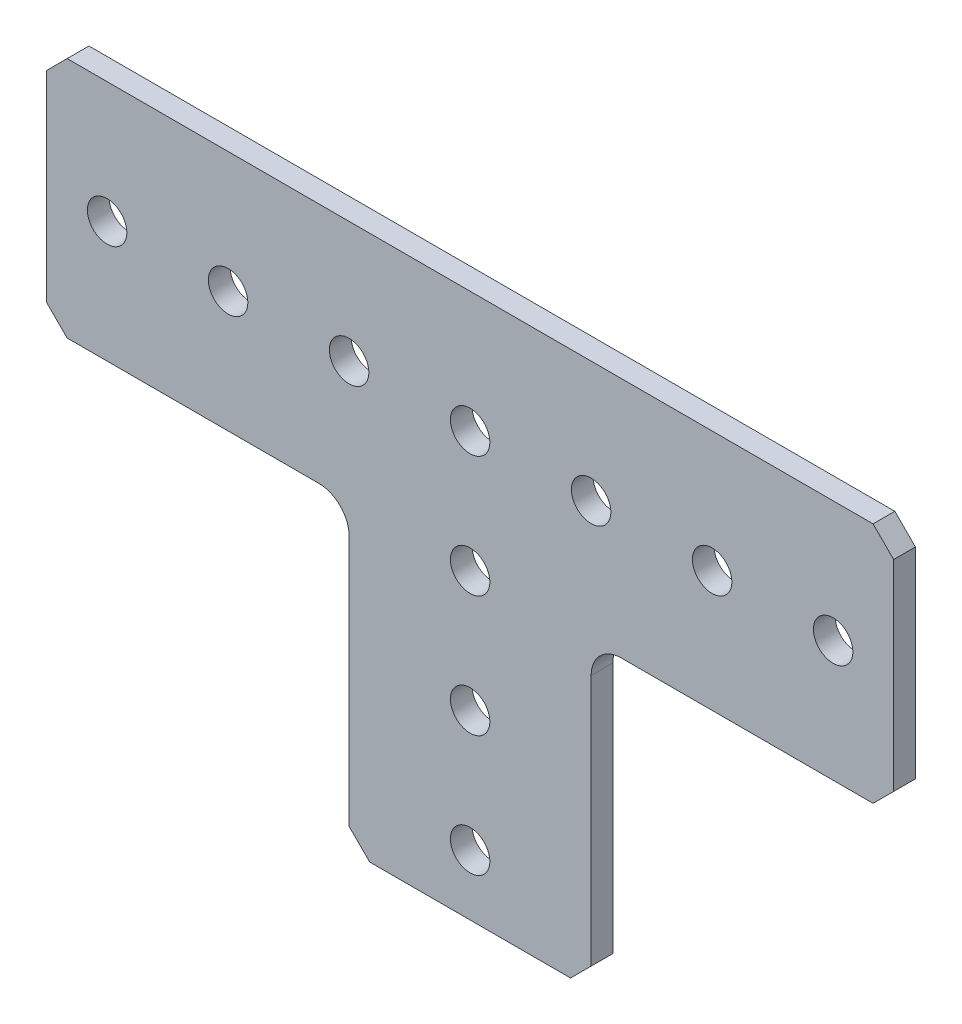
ISO-10303-21;
HEADER;
FILE_DESCRIPTION(('STEP AP214'),'2;1');
FILE_NAME('part.step','',(''),(''),'','','');
FILE_SCHEMA(('AUTOMOTIVE_DESIGN { 1 0 10303 214 1 1 1 1 }'));
ENDSEC;
DATA;
#1=APPLICATION_CONTEXT('core data for automotive mechanical design processes');
#2=APPLICATION_PROTOCOL_DEFINITION('international standard','automotive_design',2000,#1);
#3=PRODUCT_CONTEXT('',#1,'mechanical');
#4=PRODUCT('Part','Part','',(#3));
#5=PRODUCT_RELATED_PRODUCT_CATEGORY('part','',(#4));
#6=PRODUCT_DEFINITION_FORMATION('','',#4);
#7=PRODUCT_DEFINITION_CONTEXT('part definition',#1,'design');
#8=PRODUCT_DEFINITION('design','',#6,#7);
#9=PRODUCT_DEFINITION_SHAPE('','',#8);
#10=(LENGTH_UNIT() NAMED_UNIT(*) SI_UNIT(.MILLI.,.METRE.));
#11=(NAMED_UNIT(*) PLANE_ANGLE_UNIT() SI_UNIT($,.RADIAN.));
#12=(NAMED_UNIT(*) SI_UNIT($,.STERADIAN.) SOLID_ANGLE_UNIT());
#13=UNCERTAINTY_MEASURE_WITH_UNIT(LENGTH_MEASURE(1.E-05),#10,'distance_accuracy_value','');
#14=(GEOMETRIC_REPRESENTATION_CONTEXT(3) GLOBAL_UNCERTAINTY_ASSIGNED_CONTEXT((#13)) GLOBAL_UNIT_ASSIGNED_CONTEXT((#10,
#11,#12)) REPRESENTATION_CONTEXT('',''));
#15=CARTESIAN_POINT('',(0.,0.,0.));
#16=DIRECTION('',(0.,0.,1.));
#17=DIRECTION('',(1.,0.,0.));
#18=AXIS2_PLACEMENT_3D('',#15,#16,#17);
#19=CARTESIAN_POINT('',(-44.45,0.,0.));
#20=DIRECTION('',(0.,0.,1.));
#21=DIRECTION('',(1.,0.,0.));
#22=AXIS2_PLACEMENT_3D('',#19,#20,#21);
#23=PLANE('',#22);
#24=CARTESIAN_POINT('',(0.,-12.7,0.));
#25=DIRECTION('',(0.,0.,-1.));
#26=DIRECTION('',(-1.,0.,0.));
#27=AXIS2_PLACEMENT_3D('',#24,#25,#26);
#28=CIRCLE('',#27,2.0701);
#29=CARTESIAN_POINT('',(-2.0701,-12.7,0.));
#30=VERTEX_POINT('',#29);
#31=EDGE_CURVE('E282',#30,#30,#28,.F.);
#32=ORIENTED_EDGE('',*,*,#31,.T.);
#33=EDGE_LOOP('',(#32));
#34=FACE_BOUND('',#33,.T.);
#35=CARTESIAN_POINT('',(38.1,12.7,0.));
#36=DIRECTION('',(0.,0.,-1.));
#37=DIRECTION('',(-1.,0.,0.));
#38=AXIS2_PLACEMENT_3D('',#35,#36,#37);
#39=CIRCLE('',#38,2.0701);
#40=CARTESIAN_POINT('',(36.0299,12.7,0.));
#41=VERTEX_POINT('',#40);
#42=EDGE_CURVE('E285',#41,#41,#39,.F.);
#43=ORIENTED_EDGE('',*,*,#42,.T.);
#44=EDGE_LOOP('',(#43));
#45=FACE_BOUND('',#44,.T.);
#46=CARTESIAN_POINT('',(12.7,12.7,0.));
#47=DIRECTION('',(0.,0.,-1.));
#48=DIRECTION('',(-1.,0.,0.));
#49=AXIS2_PLACEMENT_3D('',#46,#47,#48);
#50=CIRCLE('',#49,2.0701);
#51=CARTESIAN_POINT('',(10.6299,12.7,0.));
#52=VERTEX_POINT('',#51);
#53=EDGE_CURVE('E288',#52,#52,#50,.F.);
#54=ORIENTED_EDGE('',*,*,#53,.T.);
#55=EDGE_LOOP('',(#54));
#56=FACE_BOUND('',#55,.T.);
#57=CARTESIAN_POINT('',(-12.7,12.7,0.));
#58=DIRECTION('',(0.,0.,-1.));
#59=DIRECTION('',(-1.,0.,0.));
#60=AXIS2_PLACEMENT_3D('',#57,#58,#59);
#61=CIRCLE('',#60,2.0701);
#62=CARTESIAN_POINT('',(-14.7701,12.7,0.));
#63=VERTEX_POINT('',#62);
#64=EDGE_CURVE('E291',#63,#63,#61,.F.);
#65=ORIENTED_EDGE('',*,*,#64,.T.);
#66=EDGE_LOOP('',(#65));
#67=FACE_BOUND('',#66,.T.);
#68=CARTESIAN_POINT('',(-25.4,12.7,0.));
#69=DIRECTION('',(0.,0.,-1.));
#70=DIRECTION('',(-1.,0.,0.));
#71=AXIS2_PLACEMENT_3D('',#68,#69,#70);
#72=CIRCLE('',#71,2.0701);
#73=CARTESIAN_POINT('',(-27.4701,12.7,0.));
#74=VERTEX_POINT('',#73);
#75=EDGE_CURVE('E294',#74,#74,#72,.F.);
#76=ORIENTED_EDGE('',*,*,#75,.T.);
#77=EDGE_LOOP('',(#76));
#78=FACE_BOUND('',#77,.T.);
#79=DIRECTION('',(-0.707106781186547,-0.707106781186548,0.));
#80=VECTOR('',#79,1.);
#81=CARTESIAN_POINT('',(12.7,-29.591,0.));
#82=LINE('',#81,#80);
#83=CARTESIAN_POINT('',(12.7,-29.591,0.));
#84=VERTEX_POINT('',#83);
#85=CARTESIAN_POINT('',(10.541,-31.75,0.));
#86=VERTEX_POINT('',#85);
#87=EDGE_CURVE('E169',#84,#86,#82,.T.);
#88=ORIENTED_EDGE('',*,*,#87,.T.);
#89=DIRECTION('',(1.,0.,0.));
#90=VECTOR('',#89,1.);
#91=CARTESIAN_POINT('',(-12.7,-31.75,0.));
#92=LINE('',#91,#90);
#93=CARTESIAN_POINT('',(-10.541,-31.75,0.));
#94=VERTEX_POINT('',#93);
#95=EDGE_CURVE('E192',#86,#94,#92,.F.);
#96=ORIENTED_EDGE('',*,*,#95,.T.);
#97=DIRECTION('',(-0.707106781186547,0.707106781186548,0.));
#98=VECTOR('',#97,1.);
#99=CARTESIAN_POINT('',(-10.541,-31.75,0.));
#100=LINE('',#99,#98);
#101=CARTESIAN_POINT('',(-12.7,-29.591,0.));
#102=VERTEX_POINT('',#101);
#103=EDGE_CURVE('E180',#94,#102,#100,.T.);
#104=ORIENTED_EDGE('',*,*,#103,.T.);
#105=DIRECTION('',(0.,1.,0.));
#106=VECTOR('',#105,1.);
#107=CARTESIAN_POINT('',(-12.7,0.,0.));
#108=LINE('',#107,#106);
#109=CARTESIAN_POINT('',(-12.7,-3.175,0.));
#110=VERTEX_POINT('',#109);
#111=EDGE_CURVE('E184',#102,#110,#108,.T.);
#112=ORIENTED_EDGE('',*,*,#111,.T.);
#113=CARTESIAN_POINT('',(-15.875,-3.175,0.));
#114=DIRECTION('',(0.,0.,1.));
#115=DIRECTION('',(1.,0.,0.));
#116=AXIS2_PLACEMENT_3D('',#113,#114,#115);
#117=CIRCLE('',#116,3.175);
#118=CARTESIAN_POINT('',(-15.875,0.,0.));
#119=VERTEX_POINT('',#118);
#120=EDGE_CURVE('E200',#110,#119,#117,.T.);
#121=ORIENTED_EDGE('',*,*,#120,.T.);
#122=DIRECTION('',(1.,0.,0.));
#123=VECTOR('',#122,1.);
#124=CARTESIAN_POINT('',(-44.45,0.,0.));
#125=LINE('',#124,#123);
#126=CARTESIAN_POINT('',(-42.291,0.,0.));
#127=VERTEX_POINT('',#126);
#128=EDGE_CURVE('E197',#119,#127,#125,.F.);
#129=ORIENTED_EDGE('',*,*,#128,.T.);
#130=DIRECTION('',(-0.707106781186548,0.707106781186548,0.));
#131=VECTOR('',#130,1.);
#132=CARTESIAN_POINT('',(-42.291,0.,0.));
#133=LINE('',#132,#131);
#134=CARTESIAN_POINT('',(-44.45,2.159,0.));
#135=VERTEX_POINT('',#134);
#136=EDGE_CURVE('E204',#127,#135,#133,.T.);
#137=ORIENTED_EDGE('',*,*,#136,.T.);
#138=DIRECTION('',(0.,1.,0.));
#139=VECTOR('',#138,1.);
#140=CARTESIAN_POINT('',(-44.45,25.4,0.));
#141=LINE('',#140,#139);
#142=CARTESIAN_POINT('',(-44.45,23.241,0.));
#143=VERTEX_POINT('',#142);
#144=EDGE_CURVE('E207',#135,#143,#141,.T.);
#145=ORIENTED_EDGE('',*,*,#144,.T.);
#146=DIRECTION('',(0.707106781186548,0.707106781186548,0.));
#147=VECTOR('',#146,1.);
#148=CARTESIAN_POINT('',(-44.45,23.241,0.));
#149=LINE('',#148,#147);
#150=CARTESIAN_POINT('',(-42.291,25.4,0.));
#151=VERTEX_POINT('',#150);
#152=EDGE_CURVE('E215',#143,#151,#149,.T.);
#153=ORIENTED_EDGE('',*,*,#152,.T.);
#154=DIRECTION('',(1.,0.,0.));
#155=VECTOR('',#154,1.);
#156=CARTESIAN_POINT('',(-44.45,25.4,0.));
#157=LINE('',#156,#155);
#158=CARTESIAN_POINT('',(42.291,25.4,0.));
#159=VERTEX_POINT('',#158);
#160=EDGE_CURVE('E218',#151,#159,#157,.T.);
#161=ORIENTED_EDGE('',*,*,#160,.T.);
#162=DIRECTION('',(0.707106781186546,-0.707106781186549,0.));
#163=VECTOR('',#162,1.);
#164=CARTESIAN_POINT('',(42.291,25.4,0.));
#165=LINE('',#164,#163);
#166=CARTESIAN_POINT('',(44.45,23.241,0.));
#167=VERTEX_POINT('',#166);
#168=EDGE_CURVE('E226',#159,#167,#165,.T.);
#169=ORIENTED_EDGE('',*,*,#168,.T.);
#170=DIRECTION('',(0.,1.,0.));
#171=VECTOR('',#170,1.);
#172=CARTESIAN_POINT('',(44.45,25.4,0.));
#173=LINE('',#172,#171);
#174=CARTESIAN_POINT('',(44.45,2.15900000000001,0.));
#175=VERTEX_POINT('',#174);
#176=EDGE_CURVE('E229',#167,#175,#173,.F.);
#177=ORIENTED_EDGE('',*,*,#176,.T.);
#178=DIRECTION('',(-0.707106781186548,-0.707106781186548,0.));
#179=VECTOR('',#178,1.);
#180=CARTESIAN_POINT('',(44.45,2.159,0.));
#181=LINE('',#180,#179);
#182=CARTESIAN_POINT('',(42.291,0.,0.));
#183=VERTEX_POINT('',#182);
#184=EDGE_CURVE('E237',#175,#183,#181,.T.);
#185=ORIENTED_EDGE('',*,*,#184,.T.);
#186=DIRECTION('',(-1.,0.,0.));
#187=VECTOR('',#186,1.);
#188=CARTESIAN_POINT('',(44.45,0.,0.));
#189=LINE('',#188,#187);
#190=CARTESIAN_POINT('',(15.875,0.,0.));
#191=VERTEX_POINT('',#190);
#192=EDGE_CURVE('E128',#183,#191,#189,.T.);
#193=ORIENTED_EDGE('',*,*,#192,.T.);
#194=CARTESIAN_POINT('',(15.875,-3.175,0.));
#195=DIRECTION('',(0.,0.,1.));
#196=DIRECTION('',(1.,0.,0.));
#197=AXIS2_PLACEMENT_3D('',#194,#195,#196);
#198=CIRCLE('',#197,3.175);
#199=CARTESIAN_POINT('',(12.7,-3.175,0.));
#200=VERTEX_POINT('',#199);
#201=EDGE_CURVE('E131',#191,#200,#198,.T.);
#202=ORIENTED_EDGE('',*,*,#201,.T.);
#203=DIRECTION('',(0.,-1.,0.));
#204=VECTOR('',#203,1.);
#205=CARTESIAN_POINT('',(12.7,0.,0.));
#206=LINE('',#205,#204);
#207=EDGE_CURVE('E134',#200,#84,#206,.T.);
#208=ORIENTED_EDGE('',*,*,#207,.T.);
#209=EDGE_LOOP('',(#88,#96,#104,#112,#121,#129,#137,#145,#153,#161,#169,#177,#185,#193,#202,#208));
#210=FACE_BOUND('',#209,.T.);
#211=CARTESIAN_POINT('',(-38.1,12.7,0.));
#212=DIRECTION('',(0.,0.,-1.));
#213=DIRECTION('',(-1.,0.,0.));
#214=AXIS2_PLACEMENT_3D('',#211,#212,#213);
#215=CIRCLE('',#214,2.0701);
#216=CARTESIAN_POINT('',(-40.1701,12.7,0.));
#217=VERTEX_POINT('',#216);
#218=EDGE_CURVE('E194',#217,#217,#215,.F.);
#219=ORIENTED_EDGE('',*,*,#218,.T.);
#220=EDGE_LOOP('',(#219));
#221=FACE_BOUND('',#220,.T.);
#222=CARTESIAN_POINT('',(0.,-25.4,0.));
#223=DIRECTION('',(0.,0.,-1.));
#224=DIRECTION('',(-1.,0.,0.));
#225=AXIS2_PLACEMENT_3D('',#222,#223,#224);
#226=CIRCLE('',#225,2.0701);
#227=CARTESIAN_POINT('',(-2.0701,-25.4,0.));
#228=VERTEX_POINT('',#227);
#229=EDGE_CURVE('E300',#228,#228,#226,.F.);
#230=ORIENTED_EDGE('',*,*,#229,.T.);
#231=EDGE_LOOP('',(#230));
#232=FACE_BOUND('',#231,.T.);
#233=CARTESIAN_POINT('',(0.,12.7,0.));
#234=DIRECTION('',(0.,0.,-1.));
#235=DIRECTION('',(-1.,0.,0.));
#236=AXIS2_PLACEMENT_3D('',#233,#234,#235);
#237=CIRCLE('',#236,2.0701);
#238=CARTESIAN_POINT('',(-2.0701,12.7,0.));
#239=VERTEX_POINT('',#238);
#240=EDGE_CURVE('E303',#239,#239,#237,.F.);
#241=ORIENTED_EDGE('',*,*,#240,.T.);
#242=EDGE_LOOP('',(#241));
#243=FACE_BOUND('',#242,.T.);
#244=CARTESIAN_POINT('',(25.4,12.7,0.));
#245=DIRECTION('',(0.,0.,-1.));
#246=DIRECTION('',(-1.,0.,0.));
#247=AXIS2_PLACEMENT_3D('',#244,#245,#246);
#248=CIRCLE('',#247,2.0701);
#249=CARTESIAN_POINT('',(23.3299,12.7,0.));
#250=VERTEX_POINT('',#249);
#251=EDGE_CURVE('E305',#250,#250,#248,.F.);
#252=ORIENTED_EDGE('',*,*,#251,.T.);
#253=EDGE_LOOP('',(#252));
#254=FACE_BOUND('',#253,.T.);
#255=CARTESIAN_POINT('',(0.,0.,0.));
#256=DIRECTION('',(0.,0.,-1.));
#257=DIRECTION('',(-1.,0.,0.));
#258=AXIS2_PLACEMENT_3D('',#255,#256,#257);
#259=CIRCLE('',#258,2.0701);
#260=CARTESIAN_POINT('',(-2.0701,0.,0.));
#261=VERTEX_POINT('',#260);
#262=EDGE_CURVE('E20',#261,#261,#259,.F.);
#263=ORIENTED_EDGE('',*,*,#262,.T.);
#264=EDGE_LOOP('',(#263));
#265=FACE_BOUND('',#264,.T.);
#266=ADVANCED_FACE('F17',(#34,#45,#56,#67,#78,#210,#221,#232,#243,#254,#265),#23,.F.);
#267=CARTESIAN_POINT('',(0.,0.,2.286));
#268=DIRECTION('',(0.,0.,-1.));
#269=DIRECTION('',(-1.,0.,0.));
#270=AXIS2_PLACEMENT_3D('',#267,#268,#269);
#271=CYLINDRICAL_SURFACE('',#270,2.0701);
#272=CARTESIAN_POINT('',(0.,0.,2.286));
#273=DIRECTION('',(0.,0.,-1.));
#274=DIRECTION('',(-1.,0.,0.));
#275=AXIS2_PLACEMENT_3D('',#272,#273,#274);
#276=CIRCLE('',#275,2.0701);
#277=CARTESIAN_POINT('',(-2.0701,0.,2.286));
#278=VERTEX_POINT('',#277);
#279=EDGE_CURVE('E279',#278,#278,#276,.T.);
#280=ORIENTED_EDGE('',*,*,#279,.F.);
#281=EDGE_LOOP('',(#280));
#282=FACE_BOUND('',#281,.T.);
#283=ORIENTED_EDGE('',*,*,#262,.F.);
#284=EDGE_LOOP('',(#283));
#285=FACE_BOUND('',#284,.T.);
#286=ADVANCED_FACE('F313',(#282,#285),#271,.F.);
#287=CARTESIAN_POINT('',(25.4,12.7,2.286));
#288=DIRECTION('',(0.,0.,-1.));
#289=DIRECTION('',(-1.,0.,0.));
#290=AXIS2_PLACEMENT_3D('',#287,#288,#289);
#291=CYLINDRICAL_SURFACE('',#290,2.0701);
#292=CARTESIAN_POINT('',(25.4,12.7,2.286));
#293=DIRECTION('',(0.,0.,-1.));
#294=DIRECTION('',(-1.,0.,0.));
#295=AXIS2_PLACEMENT_3D('',#292,#293,#294);
#296=CIRCLE('',#295,2.0701);
#297=CARTESIAN_POINT('',(23.3299,12.7,2.286));
#298=VERTEX_POINT('',#297);
#299=EDGE_CURVE('E276',#298,#298,#296,.T.);
#300=ORIENTED_EDGE('',*,*,#299,.F.);
#301=EDGE_LOOP('',(#300));
#302=FACE_BOUND('',#301,.T.);
#303=ORIENTED_EDGE('',*,*,#251,.F.);
#304=EDGE_LOOP('',(#303));
#305=FACE_BOUND('',#304,.T.);
#306=ADVANCED_FACE('F315',(#302,#305),#291,.F.);
#307=CARTESIAN_POINT('',(0.,12.7,2.286));
#308=DIRECTION('',(0.,0.,-1.));
#309=DIRECTION('',(-1.,0.,0.));
#310=AXIS2_PLACEMENT_3D('',#307,#308,#309);
#311=CYLINDRICAL_SURFACE('',#310,2.0701);
#312=CARTESIAN_POINT('',(0.,12.7,2.286));
#313=DIRECTION('',(0.,0.,-1.));
#314=DIRECTION('',(-1.,0.,0.));
#315=AXIS2_PLACEMENT_3D('',#312,#313,#314);
#316=CIRCLE('',#315,2.0701);
#317=CARTESIAN_POINT('',(-2.0701,12.7,2.286));
#318=VERTEX_POINT('',#317);
#319=EDGE_CURVE('E273',#318,#318,#316,.T.);
#320=ORIENTED_EDGE('',*,*,#319,.F.);
#321=EDGE_LOOP('',(#320));
#322=FACE_BOUND('',#321,.T.);
#323=ORIENTED_EDGE('',*,*,#240,.F.);
#324=EDGE_LOOP('',(#323));
#325=FACE_BOUND('',#324,.T.);
#326=ADVANCED_FACE('F322',(#322,#325),#311,.F.);
#327=CARTESIAN_POINT('',(0.,-25.4,2.286));
#328=DIRECTION('',(0.,0.,-1.));
#329=DIRECTION('',(-1.,0.,0.));
#330=AXIS2_PLACEMENT_3D('',#327,#328,#329);
#331=CYLINDRICAL_SURFACE('',#330,2.0701);
#332=CARTESIAN_POINT('',(0.,-25.4,2.286));
#333=DIRECTION('',(0.,0.,-1.));
#334=DIRECTION('',(-1.,0.,0.));
#335=AXIS2_PLACEMENT_3D('',#332,#333,#334);
#336=CIRCLE('',#335,2.0701);
#337=CARTESIAN_POINT('',(-2.0701,-25.4,2.286));
#338=VERTEX_POINT('',#337);
#339=EDGE_CURVE('E270',#338,#338,#336,.T.);
#340=ORIENTED_EDGE('',*,*,#339,.F.);
#341=EDGE_LOOP('',(#340));
#342=FACE_BOUND('',#341,.T.);
#343=ORIENTED_EDGE('',*,*,#229,.F.);
#344=EDGE_LOOP('',(#343));
#345=FACE_BOUND('',#344,.T.);
#346=ADVANCED_FACE('F417',(#342,#345),#331,.F.);
#347=CARTESIAN_POINT('',(-38.1,12.7,2.286));
#348=DIRECTION('',(0.,0.,-1.));
#349=DIRECTION('',(-1.,0.,0.));
#350=AXIS2_PLACEMENT_3D('',#347,#348,#349);
#351=CYLINDRICAL_SURFACE('',#350,2.0701);
#352=CARTESIAN_POINT('',(-38.1,12.7,2.286));
#353=DIRECTION('',(0.,0.,-1.));
#354=DIRECTION('',(-1.,0.,0.));
#355=AXIS2_PLACEMENT_3D('',#352,#353,#354);
#356=CIRCLE('',#355,2.0701);
#357=CARTESIAN_POINT('',(-40.1701,12.7,2.286));
#358=VERTEX_POINT('',#357);
#359=EDGE_CURVE('E174',#358,#358,#356,.T.);
#360=ORIENTED_EDGE('',*,*,#359,.F.);
#361=EDGE_LOOP('',(#360));
#362=FACE_BOUND('',#361,.T.);
#363=ORIENTED_EDGE('',*,*,#218,.F.);
#364=EDGE_LOOP('',(#363));
#365=FACE_BOUND('',#364,.T.);
#366=ADVANCED_FACE('F413',(#362,#365),#351,.F.);
#367=CARTESIAN_POINT('',(-12.7,-31.75,2.286));
#368=DIRECTION('',(0.,1.,0.));
#369=DIRECTION('',(0.,0.,1.));
#370=AXIS2_PLACEMENT_3D('',#367,#368,#369);
#371=PLANE('',#370);
#372=DIRECTION('',(0.,0.,1.));
#373=VECTOR('',#372,1.);
#374=CARTESIAN_POINT('',(10.541,-31.75,2.286));
#375=LINE('',#374,#373);
#376=CARTESIAN_POINT('',(10.541,-31.75,2.286));
#377=VERTEX_POINT('',#376);
#378=EDGE_CURVE('E158',#86,#377,#375,.T.);
#379=ORIENTED_EDGE('',*,*,#378,.T.);
#380=DIRECTION('',(1.,0.,0.));
#381=VECTOR('',#380,1.);
#382=CARTESIAN_POINT('',(-44.45,-31.75,2.286));
#383=LINE('',#382,#381);
#384=CARTESIAN_POINT('',(-10.541,-31.75,2.286));
#385=VERTEX_POINT('',#384);
#386=EDGE_CURVE('E165',#385,#377,#383,.T.);
#387=ORIENTED_EDGE('',*,*,#386,.F.);
#388=DIRECTION('',(0.,0.,1.));
#389=VECTOR('',#388,1.);
#390=CARTESIAN_POINT('',(-10.541,-31.75,2.286));
#391=LINE('',#390,#389);
#392=EDGE_CURVE('E177',#385,#94,#391,.F.);
#393=ORIENTED_EDGE('',*,*,#392,.T.);
#394=ORIENTED_EDGE('',*,*,#95,.F.);
#395=EDGE_LOOP('',(#379,#387,#393,#394));
#396=FACE_BOUND('',#395,.T.);
#397=ADVANCED_FACE('F409',(#396),#371,.F.);
#398=CARTESIAN_POINT('',(12.7,-29.591,2.286));
#399=DIRECTION('',(-0.707106781186548,0.707106781186547,0.));
#400=DIRECTION('',(-0.707106781186547,-0.707106781186548,0.));
#401=AXIS2_PLACEMENT_3D('',#398,#399,#400);
#402=PLANE('',#401);
#403=ORIENTED_EDGE('',*,*,#378,.F.);
#404=ORIENTED_EDGE('',*,*,#87,.F.);
#405=DIRECTION('',(0.,0.,1.));
#406=VECTOR('',#405,1.);
#407=CARTESIAN_POINT('',(12.7,-29.591,2.286));
#408=LINE('',#407,#406);
#409=CARTESIAN_POINT('',(12.7,-29.591,2.286));
#410=VERTEX_POINT('',#409);
#411=EDGE_CURVE('E145',#84,#410,#408,.T.);
#412=ORIENTED_EDGE('',*,*,#411,.T.);
#413=DIRECTION('',(0.707106781186547,0.707106781186547,0.));
#414=VECTOR('',#413,1.);
#415=CARTESIAN_POINT('',(10.541,-31.75,2.286));
#416=LINE('',#415,#414);
#417=EDGE_CURVE('E161',#377,#410,#416,.T.);
#418=ORIENTED_EDGE('',*,*,#417,.F.);
#419=EDGE_LOOP('',(#403,#404,#412,#418));
#420=FACE_BOUND('',#419,.T.);
#421=ADVANCED_FACE('F406',(#420),#402,.F.);
#422=CARTESIAN_POINT('',(12.7,0.,2.286));
#423=DIRECTION('',(-1.,0.,0.));
#424=DIRECTION('',(0.,-1.,0.));
#425=AXIS2_PLACEMENT_3D('',#422,#423,#424);
#426=PLANE('',#425);
#427=DIRECTION('',(0.,0.,1.));
#428=VECTOR('',#427,1.);
#429=CARTESIAN_POINT('',(12.7,-3.175,2.286));
#430=LINE('',#429,#428);
#431=CARTESIAN_POINT('',(12.7,-3.175,2.286));
#432=VERTEX_POINT('',#431);
#433=EDGE_CURVE('E139',#200,#432,#430,.T.);
#434=ORIENTED_EDGE('',*,*,#433,.T.);
#435=DIRECTION('',(0.,1.,0.));
#436=VECTOR('',#435,1.);
#437=CARTESIAN_POINT('',(12.7,0.,2.286));
#438=LINE('',#437,#436);
#439=EDGE_CURVE('E164',#410,#432,#438,.T.);
#440=ORIENTED_EDGE('',*,*,#439,.F.);
#441=ORIENTED_EDGE('',*,*,#411,.F.);
#442=ORIENTED_EDGE('',*,*,#207,.F.);
#443=EDGE_LOOP('',(#434,#440,#441,#442));
#444=FACE_BOUND('',#443,.T.);
#445=ADVANCED_FACE('F142',(#444),#426,.F.);
#446=CARTESIAN_POINT('',(15.875,-3.175,2.286));
#447=DIRECTION('',(0.,0.,1.));
#448=DIRECTION('',(1.,0.,0.));
#449=AXIS2_PLACEMENT_3D('',#446,#447,#448);
#450=CYLINDRICAL_SURFACE('',#449,3.175);
#451=ORIENTED_EDGE('',*,*,#433,.F.);
#452=ORIENTED_EDGE('',*,*,#201,.F.);
#453=DIRECTION('',(0.,0.,1.));
#454=VECTOR('',#453,1.);
#455=CARTESIAN_POINT('',(15.875,0.,2.286));
#456=LINE('',#455,#454);
#457=CARTESIAN_POINT('',(15.875,0.,2.286));
#458=VERTEX_POINT('',#457);
#459=EDGE_CURVE('E152',#191,#458,#456,.T.);
#460=ORIENTED_EDGE('',*,*,#459,.T.);
#461=CARTESIAN_POINT('',(15.875,-3.175,2.286));
#462=DIRECTION('',(0.,0.,1.));
#463=DIRECTION('',(1.,0.,0.));
#464=AXIS2_PLACEMENT_3D('',#461,#462,#463);
#465=CIRCLE('',#464,3.175);
#466=EDGE_CURVE('E149',#432,#458,#465,.F.);
#467=ORIENTED_EDGE('',*,*,#466,.F.);
#468=EDGE_LOOP('',(#451,#452,#460,#467));
#469=FACE_BOUND('',#468,.T.);
#470=ADVANCED_FACE('F147',(#469),#450,.F.);
#471=CARTESIAN_POINT('',(44.45,0.,2.286));
#472=DIRECTION('',(0.,1.,0.));
#473=DIRECTION('',(-1.,0.,0.));
#474=AXIS2_PLACEMENT_3D('',#471,#472,#473);
#475=PLANE('',#474);
#476=ORIENTED_EDGE('',*,*,#459,.F.);
#477=ORIENTED_EDGE('',*,*,#192,.F.);
#478=DIRECTION('',(0.,0.,1.));
#479=VECTOR('',#478,1.);
#480=CARTESIAN_POINT('',(42.291,0.,2.286));
#481=LINE('',#480,#479);
#482=CARTESIAN_POINT('',(42.291,0.,2.286));
#483=VERTEX_POINT('',#482);
#484=EDGE_CURVE('E239',#183,#483,#481,.T.);
#485=ORIENTED_EDGE('',*,*,#484,.T.);
#486=DIRECTION('',(1.,0.,0.));
#487=VECTOR('',#486,1.);
#488=CARTESIAN_POINT('',(-44.45,0.,2.286));
#489=LINE('',#488,#487);
#490=EDGE_CURVE('E267',#458,#483,#489,.T.);
#491=ORIENTED_EDGE('',*,*,#490,.F.);
#492=EDGE_LOOP('',(#476,#477,#485,#491));
#493=FACE_BOUND('',#492,.T.);
#494=ADVANCED_FACE('F397',(#493),#475,.F.);
#495=CARTESIAN_POINT('',(44.45,2.159,2.286));
#496=DIRECTION('',(-0.707106781186548,0.707106781186548,0.));
#497=DIRECTION('',(-0.707106781186548,-0.707106781186548,0.));
#498=AXIS2_PLACEMENT_3D('',#495,#496,#497);
#499=PLANE('',#498);
#500=ORIENTED_EDGE('',*,*,#484,.F.);
#501=ORIENTED_EDGE('',*,*,#184,.F.);
#502=DIRECTION('',(0.,0.,1.));
#503=VECTOR('',#502,1.);
#504=CARTESIAN_POINT('',(44.45,2.15900000000001,2.286));
#505=LINE('',#504,#503);
#506=CARTESIAN_POINT('',(44.45,2.15900000000003,2.286));
#507=VERTEX_POINT('',#506);
#508=EDGE_CURVE('E234',#175,#507,#505,.T.);
#509=ORIENTED_EDGE('',*,*,#508,.T.);
#510=DIRECTION('',(0.707106781186543,0.707106781186552,0.));
#511=VECTOR('',#510,1.);
#512=CARTESIAN_POINT('',(42.291,0.,2.286));
#513=LINE('',#512,#511);
#514=EDGE_CURVE('E680',#483,#507,#513,.T.);
#515=ORIENTED_EDGE('',*,*,#514,.F.);
#516=EDGE_LOOP('',(#500,#501,#509,#515));
#517=FACE_BOUND('',#516,.T.);
#518=ADVANCED_FACE('F393',(#517),#499,.F.);
#519=CARTESIAN_POINT('',(44.45,25.4,2.286));
#520=DIRECTION('',(-1.,0.,0.));
#521=DIRECTION('',(0.,0.,1.));
#522=AXIS2_PLACEMENT_3D('',#519,#520,#521);
#523=PLANE('',#522);
#524=DIRECTION('',(0.,0.,1.));
#525=VECTOR('',#524,1.);
#526=CARTESIAN_POINT('',(44.45,23.241,2.286));
#527=LINE('',#526,#525);
#528=CARTESIAN_POINT('',(44.45,23.241,2.286));
#529=VERTEX_POINT('',#528);
#530=EDGE_CURVE('E228',#167,#529,#527,.T.);
#531=ORIENTED_EDGE('',*,*,#530,.T.);
#532=DIRECTION('',(0.,1.,0.));
#533=VECTOR('',#532,1.);
#534=CARTESIAN_POINT('',(44.45,0.,2.286));
#535=LINE('',#534,#533);
#536=EDGE_CURVE('E672',#507,#529,#535,.T.);
#537=ORIENTED_EDGE('',*,*,#536,.F.);
#538=ORIENTED_EDGE('',*,*,#508,.F.);
#539=ORIENTED_EDGE('',*,*,#176,.F.);
#540=EDGE_LOOP('',(#531,#537,#538,#539));
#541=FACE_BOUND('',#540,.T.);
#542=ADVANCED_FACE('F389',(#541),#523,.F.);
#543=CARTESIAN_POINT('',(42.291,25.4,2.286));
#544=DIRECTION('',(-0.707106781186549,-0.707106781186546,0.));
#545=DIRECTION('',(0.707106781186546,-0.707106781186549,0.));
#546=AXIS2_PLACEMENT_3D('',#543,#544,#545);
#547=PLANE('',#546);
#548=ORIENTED_EDGE('',*,*,#530,.F.);
#549=ORIENTED_EDGE('',*,*,#168,.F.);
#550=DIRECTION('',(0.,0.,-1.));
#551=VECTOR('',#550,1.);
#552=CARTESIAN_POINT('',(42.291,25.4,2.286));
#553=LINE('',#552,#551);
#554=CARTESIAN_POINT('',(42.291,25.4,2.286));
#555=VERTEX_POINT('',#554);
#556=EDGE_CURVE('E223',#159,#555,#553,.F.);
#557=ORIENTED_EDGE('',*,*,#556,.T.);
#558=DIRECTION('',(-0.707106781186548,0.707106781186548,0.));
#559=VECTOR('',#558,1.);
#560=CARTESIAN_POINT('',(44.45,23.241,2.286));
#561=LINE('',#560,#559);
#562=EDGE_CURVE('E664',#529,#555,#561,.T.);
#563=ORIENTED_EDGE('',*,*,#562,.F.);
#564=EDGE_LOOP('',(#548,#549,#557,#563));
#565=FACE_BOUND('',#564,.T.);
#566=ADVANCED_FACE('F385',(#565),#547,.F.);
#567=CARTESIAN_POINT('',(-44.45,25.4,2.286));
#568=DIRECTION('',(0.,-1.,0.));
#569=DIRECTION('',(0.,0.,-1.));
#570=AXIS2_PLACEMENT_3D('',#567,#568,#569);
#571=PLANE('',#570);
#572=DIRECTION('',(0.,0.,1.));
#573=VECTOR('',#572,1.);
#574=CARTESIAN_POINT('',(-42.291,25.4,2.286));
#575=LINE('',#574,#573);
#576=CARTESIAN_POINT('',(-42.291,25.4,2.286));
#577=VERTEX_POINT('',#576);
#578=EDGE_CURVE('E217',#151,#577,#575,.T.);
#579=ORIENTED_EDGE('',*,*,#578,.T.);
#580=DIRECTION('',(1.,0.,0.));
#581=VECTOR('',#580,1.);
#582=CARTESIAN_POINT('',(-44.45,25.4,2.286));
#583=LINE('',#582,#581);
#584=EDGE_CURVE('E656',#555,#577,#583,.F.);
#585=ORIENTED_EDGE('',*,*,#584,.F.);
#586=ORIENTED_EDGE('',*,*,#556,.F.);
#587=ORIENTED_EDGE('',*,*,#160,.F.);
#588=EDGE_LOOP('',(#579,#585,#586,#587));
#589=FACE_BOUND('',#588,.T.);
#590=ADVANCED_FACE('F381',(#589),#571,.F.);
#591=CARTESIAN_POINT('',(-44.45,23.241,2.286));
#592=DIRECTION('',(0.707106781186548,-0.707106781186548,0.));
#593=DIRECTION('',(0.707106781186548,0.707106781186548,0.));
#594=AXIS2_PLACEMENT_3D('',#591,#592,#593);
#595=PLANE('',#594);
#596=ORIENTED_EDGE('',*,*,#578,.F.);
#597=ORIENTED_EDGE('',*,*,#152,.F.);
#598=DIRECTION('',(0.,0.,-1.));
#599=VECTOR('',#598,1.);
#600=CARTESIAN_POINT('',(-44.45,23.241,2.286));
#601=LINE('',#600,#599);
#602=CARTESIAN_POINT('',(-44.45,23.241,2.286));
#603=VERTEX_POINT('',#602);
#604=EDGE_CURVE('E212',#143,#603,#601,.F.);
#605=ORIENTED_EDGE('',*,*,#604,.T.);
#606=DIRECTION('',(-0.707106781186546,-0.707106781186549,0.));
#607=VECTOR('',#606,1.);
#608=CARTESIAN_POINT('',(-42.291,25.4,2.286));
#609=LINE('',#608,#607);
#610=EDGE_CURVE('E648',#577,#603,#609,.T.);
#611=ORIENTED_EDGE('',*,*,#610,.F.);
#612=EDGE_LOOP('',(#596,#597,#605,#611));
#613=FACE_BOUND('',#612,.T.);
#614=ADVANCED_FACE('F377',(#613),#595,.F.);
#615=CARTESIAN_POINT('',(-44.45,25.4,2.286));
#616=DIRECTION('',(1.,0.,0.));
#617=DIRECTION('',(0.,0.,-1.));
#618=AXIS2_PLACEMENT_3D('',#615,#616,#617);
#619=PLANE('',#618);
#620=DIRECTION('',(0.,0.,1.));
#621=VECTOR('',#620,1.);
#622=CARTESIAN_POINT('',(-44.45,2.159,2.286));
#623=LINE('',#622,#621);
#624=CARTESIAN_POINT('',(-44.45,2.159,2.286));
#625=VERTEX_POINT('',#624);
#626=EDGE_CURVE('E206',#135,#625,#623,.T.);
#627=ORIENTED_EDGE('',*,*,#626,.T.);
#628=DIRECTION('',(0.,1.,0.));
#629=VECTOR('',#628,1.);
#630=CARTESIAN_POINT('',(-44.45,0.,2.286));
#631=LINE('',#630,#629);
#632=EDGE_CURVE('E640',#603,#625,#631,.F.);
#633=ORIENTED_EDGE('',*,*,#632,.F.);
#634=ORIENTED_EDGE('',*,*,#604,.F.);
#635=ORIENTED_EDGE('',*,*,#144,.F.);
#636=EDGE_LOOP('',(#627,#633,#634,#635));
#637=FACE_BOUND('',#636,.T.);
#638=ADVANCED_FACE('F373',(#637),#619,.F.);
#639=CARTESIAN_POINT('',(-42.291,0.,2.286));
#640=DIRECTION('',(0.707106781186548,0.707106781186548,0.));
#641=DIRECTION('',(-0.707106781186548,0.707106781186548,0.));
#642=AXIS2_PLACEMENT_3D('',#639,#640,#641);
#643=PLANE('',#642);
#644=ORIENTED_EDGE('',*,*,#626,.F.);
#645=ORIENTED_EDGE('',*,*,#136,.F.);
#646=DIRECTION('',(0.,0.,1.));
#647=VECTOR('',#646,1.);
#648=CARTESIAN_POINT('',(-42.291,0.,2.286));
#649=LINE('',#648,#647);
#650=CARTESIAN_POINT('',(-42.291,0.,2.286));
#651=VERTEX_POINT('',#650);
#652=EDGE_CURVE('E201',#127,#651,#649,.T.);
#653=ORIENTED_EDGE('',*,*,#652,.T.);
#654=DIRECTION('',(0.707106781186547,-0.707106781186548,0.));
#655=VECTOR('',#654,1.);
#656=CARTESIAN_POINT('',(-44.45,2.15900000000001,2.286));
#657=LINE('',#656,#655);
#658=EDGE_CURVE('E637',#625,#651,#657,.T.);
#659=ORIENTED_EDGE('',*,*,#658,.F.);
#660=EDGE_LOOP('',(#644,#645,#653,#659));
#661=FACE_BOUND('',#660,.T.);
#662=ADVANCED_FACE('F369',(#661),#643,.F.);
#663=CARTESIAN_POINT('',(-44.45,0.,2.286));
#664=DIRECTION('',(0.,1.,0.));
#665=DIRECTION('',(0.,0.,1.));
#666=AXIS2_PLACEMENT_3D('',#663,#664,#665);
#667=PLANE('',#666);
#668=DIRECTION('',(0.,0.,1.));
#669=VECTOR('',#668,1.);
#670=CARTESIAN_POINT('',(-15.875,0.,2.286));
#671=LINE('',#670,#669);
#672=CARTESIAN_POINT('',(-15.875,0.,2.286));
#673=VERTEX_POINT('',#672);
#674=EDGE_CURVE('E186',#119,#673,#671,.T.);
#675=ORIENTED_EDGE('',*,*,#674,.T.);
#676=DIRECTION('',(1.,0.,0.));
#677=VECTOR('',#676,1.);
#678=CARTESIAN_POINT('',(-44.45,0.,2.286));
#679=LINE('',#678,#677);
#680=EDGE_CURVE('E265',#651,#673,#679,.T.);
#681=ORIENTED_EDGE('',*,*,#680,.F.);
#682=ORIENTED_EDGE('',*,*,#652,.F.);
#683=ORIENTED_EDGE('',*,*,#128,.F.);
#684=EDGE_LOOP('',(#675,#681,#682,#683));
#685=FACE_BOUND('',#684,.T.);
#686=ADVANCED_FACE('F365',(#685),#667,.F.);
#687=CARTESIAN_POINT('',(-15.875,-3.175,2.286));
#688=DIRECTION('',(0.,0.,1.));
#689=DIRECTION('',(1.,0.,0.));
#690=AXIS2_PLACEMENT_3D('',#687,#688,#689);
#691=CYLINDRICAL_SURFACE('',#690,3.175);
#692=ORIENTED_EDGE('',*,*,#674,.F.);
#693=ORIENTED_EDGE('',*,*,#120,.F.);
#694=DIRECTION('',(0.,0.,1.));
#695=VECTOR('',#694,1.);
#696=CARTESIAN_POINT('',(-12.7,-3.175,2.286));
#697=LINE('',#696,#695);
#698=CARTESIAN_POINT('',(-12.7,-3.175,2.286));
#699=VERTEX_POINT('',#698);
#700=EDGE_CURVE('E181',#110,#699,#697,.T.);
#701=ORIENTED_EDGE('',*,*,#700,.T.);
#702=CARTESIAN_POINT('',(-15.875,-3.175,2.286));
#703=DIRECTION('',(0.,0.,1.));
#704=DIRECTION('',(1.,0.,0.));
#705=AXIS2_PLACEMENT_3D('',#702,#703,#704);
#706=CIRCLE('',#705,3.175);
#707=EDGE_CURVE('E261',#673,#699,#706,.F.);
#708=ORIENTED_EDGE('',*,*,#707,.F.);
#709=EDGE_LOOP('',(#692,#693,#701,#708));
#710=FACE_BOUND('',#709,.T.);
#711=ADVANCED_FACE('F362',(#710),#691,.F.);
#712=CARTESIAN_POINT('',(-12.7,0.,2.286));
#713=DIRECTION('',(1.,0.,0.));
#714=DIRECTION('',(0.,1.,0.));
#715=AXIS2_PLACEMENT_3D('',#712,#713,#714);
#716=PLANE('',#715);
#717=ORIENTED_EDGE('',*,*,#700,.F.);
#718=ORIENTED_EDGE('',*,*,#111,.F.);
#719=DIRECTION('',(0.,0.,1.));
#720=VECTOR('',#719,1.);
#721=CARTESIAN_POINT('',(-12.7,-29.591,2.286));
#722=LINE('',#721,#720);
#723=CARTESIAN_POINT('',(-12.7,-29.591,2.286));
#724=VERTEX_POINT('',#723);
#725=EDGE_CURVE('E35',#102,#724,#722,.T.);
#726=ORIENTED_EDGE('',*,*,#725,.T.);
#727=DIRECTION('',(0.,1.,0.));
#728=VECTOR('',#727,1.);
#729=CARTESIAN_POINT('',(-12.7,0.,2.286));
#730=LINE('',#729,#728);
#731=EDGE_CURVE('E264',#699,#724,#730,.F.);
#732=ORIENTED_EDGE('',*,*,#731,.F.);
#733=EDGE_LOOP('',(#717,#718,#726,#732));
#734=FACE_BOUND('',#733,.T.);
#735=ADVANCED_FACE('F358',(#734),#716,.F.);
#736=CARTESIAN_POINT('',(-10.541,-31.75,2.286));
#737=DIRECTION('',(0.707106781186548,0.707106781186547,0.));
#738=DIRECTION('',(-0.707106781186547,0.707106781186548,0.));
#739=AXIS2_PLACEMENT_3D('',#736,#737,#738);
#740=PLANE('',#739);
#741=ORIENTED_EDGE('',*,*,#725,.F.);
#742=ORIENTED_EDGE('',*,*,#103,.F.);
#743=ORIENTED_EDGE('',*,*,#392,.F.);
#744=DIRECTION('',(0.707106781186544,-0.707106781186551,0.));
#745=VECTOR('',#744,1.);
#746=CARTESIAN_POINT('',(-12.7,-29.591,2.286));
#747=LINE('',#746,#745);
#748=EDGE_CURVE('E260',#724,#385,#747,.T.);
#749=ORIENTED_EDGE('',*,*,#748,.F.);
#750=EDGE_LOOP('',(#741,#742,#743,#749));
#751=FACE_BOUND('',#750,.T.);
#752=ADVANCED_FACE('F354',(#751),#740,.F.);
#753=CARTESIAN_POINT('',(-25.4,12.7,2.286));
#754=DIRECTION('',(0.,0.,-1.));
#755=DIRECTION('',(-1.,0.,0.));
#756=AXIS2_PLACEMENT_3D('',#753,#754,#755);
#757=CYLINDRICAL_SURFACE('',#756,2.0701);
#758=CARTESIAN_POINT('',(-25.4,12.7,2.286));
#759=DIRECTION('',(0.,0.,-1.));
#760=DIRECTION('',(-1.,0.,0.));
#761=AXIS2_PLACEMENT_3D('',#758,#759,#760);
#762=CIRCLE('',#761,2.0701);
#763=CARTESIAN_POINT('',(-27.4701,12.7,2.286));
#764=VERTEX_POINT('',#763);
#765=EDGE_CURVE('E257',#764,#764,#762,.T.);
#766=ORIENTED_EDGE('',*,*,#765,.F.);
#767=EDGE_LOOP('',(#766));
#768=FACE_BOUND('',#767,.T.);
#769=ORIENTED_EDGE('',*,*,#75,.F.);
#770=EDGE_LOOP('',(#769));
#771=FACE_BOUND('',#770,.T.);
#772=ADVANCED_FACE('F350',(#768,#771),#757,.F.);
#773=CARTESIAN_POINT('',(-12.7,12.7,2.286));
#774=DIRECTION('',(0.,0.,-1.));
#775=DIRECTION('',(-1.,0.,0.));
#776=AXIS2_PLACEMENT_3D('',#773,#774,#775);
#777=CYLINDRICAL_SURFACE('',#776,2.0701);
#778=CARTESIAN_POINT('',(-12.7,12.7,2.286));
#779=DIRECTION('',(0.,0.,-1.));
#780=DIRECTION('',(-1.,0.,0.));
#781=AXIS2_PLACEMENT_3D('',#778,#779,#780);
#782=CIRCLE('',#781,2.0701);
#783=CARTESIAN_POINT('',(-14.7701,12.7,2.286));
#784=VERTEX_POINT('',#783);
#785=EDGE_CURVE('E254',#784,#784,#782,.T.);
#786=ORIENTED_EDGE('',*,*,#785,.F.);
#787=EDGE_LOOP('',(#786));
#788=FACE_BOUND('',#787,.T.);
#789=ORIENTED_EDGE('',*,*,#64,.F.);
#790=EDGE_LOOP('',(#789));
#791=FACE_BOUND('',#790,.T.);
#792=ADVANCED_FACE('F346',(#788,#791),#777,.F.);
#793=CARTESIAN_POINT('',(12.7,12.7,2.286));
#794=DIRECTION('',(0.,0.,-1.));
#795=DIRECTION('',(-1.,0.,0.));
#796=AXIS2_PLACEMENT_3D('',#793,#794,#795);
#797=CYLINDRICAL_SURFACE('',#796,2.0701);
#798=CARTESIAN_POINT('',(12.7,12.7,2.286));
#799=DIRECTION('',(0.,0.,-1.));
#800=DIRECTION('',(-1.,0.,0.));
#801=AXIS2_PLACEMENT_3D('',#798,#799,#800);
#802=CIRCLE('',#801,2.0701);
#803=CARTESIAN_POINT('',(10.6299,12.7,2.286));
#804=VERTEX_POINT('',#803);
#805=EDGE_CURVE('E251',#804,#804,#802,.T.);
#806=ORIENTED_EDGE('',*,*,#805,.F.);
#807=EDGE_LOOP('',(#806));
#808=FACE_BOUND('',#807,.T.);
#809=ORIENTED_EDGE('',*,*,#53,.F.);
#810=EDGE_LOOP('',(#809));
#811=FACE_BOUND('',#810,.T.);
#812=ADVANCED_FACE('F342',(#808,#811),#797,.F.);
#813=CARTESIAN_POINT('',(38.1,12.7,2.286));
#814=DIRECTION('',(0.,0.,-1.));
#815=DIRECTION('',(-1.,0.,0.));
#816=AXIS2_PLACEMENT_3D('',#813,#814,#815);
#817=CYLINDRICAL_SURFACE('',#816,2.0701);
#818=CARTESIAN_POINT('',(38.1,12.7,2.286));
#819=DIRECTION('',(0.,0.,-1.));
#820=DIRECTION('',(-1.,0.,0.));
#821=AXIS2_PLACEMENT_3D('',#818,#819,#820);
#822=CIRCLE('',#821,2.0701);
#823=CARTESIAN_POINT('',(36.0299,12.7,2.286));
#824=VERTEX_POINT('',#823);
#825=EDGE_CURVE('E26',#824,#824,#822,.T.);
#826=ORIENTED_EDGE('',*,*,#825,.F.);
#827=EDGE_LOOP('',(#826));
#828=FACE_BOUND('',#827,.T.);
#829=ORIENTED_EDGE('',*,*,#42,.F.);
#830=EDGE_LOOP('',(#829));
#831=FACE_BOUND('',#830,.T.);
#832=ADVANCED_FACE('F335',(#828,#831),#817,.F.);
#833=CARTESIAN_POINT('',(0.,-12.7,2.286));
#834=DIRECTION('',(0.,0.,-1.));
#835=DIRECTION('',(-1.,0.,0.));
#836=AXIS2_PLACEMENT_3D('',#833,#834,#835);
#837=CYLINDRICAL_SURFACE('',#836,2.0701);
#838=CARTESIAN_POINT('',(0.,-12.7,2.286));
#839=DIRECTION('',(0.,0.,-1.));
#840=DIRECTION('',(-1.,0.,0.));
#841=AXIS2_PLACEMENT_3D('',#838,#839,#840);
#842=CIRCLE('',#841,2.0701);
#843=CARTESIAN_POINT('',(-2.0701,-12.7,2.286));
#844=VERTEX_POINT('',#843);
#845=EDGE_CURVE('E10',#844,#844,#842,.T.);
#846=ORIENTED_EDGE('',*,*,#845,.F.);
#847=EDGE_LOOP('',(#846));
#848=FACE_BOUND('',#847,.T.);
#849=ORIENTED_EDGE('',*,*,#31,.F.);
#850=EDGE_LOOP('',(#849));
#851=FACE_BOUND('',#850,.T.);
#852=ADVANCED_FACE('F329',(#848,#851),#837,.F.);
#853=CARTESIAN_POINT('',(-44.45,0.,2.286));
#854=DIRECTION('',(0.,0.,1.));
#855=DIRECTION('',(1.,0.,0.));
#856=AXIS2_PLACEMENT_3D('',#853,#854,#855);
#857=PLANE('',#856);
#858=ORIENTED_EDGE('',*,*,#845,.T.);
#859=EDGE_LOOP('',(#858));
#860=FACE_BOUND('',#859,.T.);
#861=ORIENTED_EDGE('',*,*,#825,.T.);
#862=EDGE_LOOP('',(#861));
#863=FACE_BOUND('',#862,.T.);
#864=ORIENTED_EDGE('',*,*,#805,.T.);
#865=EDGE_LOOP('',(#864));
#866=FACE_BOUND('',#865,.T.);
#867=ORIENTED_EDGE('',*,*,#785,.T.);
#868=EDGE_LOOP('',(#867));
#869=FACE_BOUND('',#868,.T.);
#870=ORIENTED_EDGE('',*,*,#765,.T.);
#871=EDGE_LOOP('',(#870));
#872=FACE_BOUND('',#871,.T.);
#873=ORIENTED_EDGE('',*,*,#731,.T.);
#874=ORIENTED_EDGE('',*,*,#748,.T.);
#875=ORIENTED_EDGE('',*,*,#386,.T.);
#876=ORIENTED_EDGE('',*,*,#417,.T.);
#877=ORIENTED_EDGE('',*,*,#439,.T.);
#878=ORIENTED_EDGE('',*,*,#466,.T.);
#879=ORIENTED_EDGE('',*,*,#490,.T.);
#880=ORIENTED_EDGE('',*,*,#514,.T.);
#881=ORIENTED_EDGE('',*,*,#536,.T.);
#882=ORIENTED_EDGE('',*,*,#562,.T.);
#883=ORIENTED_EDGE('',*,*,#584,.T.);
#884=ORIENTED_EDGE('',*,*,#610,.T.);
#885=ORIENTED_EDGE('',*,*,#632,.T.);
#886=ORIENTED_EDGE('',*,*,#658,.T.);
#887=ORIENTED_EDGE('',*,*,#680,.T.);
#888=ORIENTED_EDGE('',*,*,#707,.T.);
#889=EDGE_LOOP('',(#873,#874,#875,#876,#877,#878,#879,#880,#881,#882,#883,#884,#885,#886,#887,#888));
#890=FACE_BOUND('',#889,.T.);
#891=ORIENTED_EDGE('',*,*,#359,.T.);
#892=EDGE_LOOP('',(#891));
#893=FACE_BOUND('',#892,.T.);
#894=ORIENTED_EDGE('',*,*,#339,.T.);
#895=EDGE_LOOP('',(#894));
#896=FACE_BOUND('',#895,.T.);
#897=ORIENTED_EDGE('',*,*,#319,.T.);
#898=EDGE_LOOP('',(#897));
#899=FACE_BOUND('',#898,.T.);
#900=ORIENTED_EDGE('',*,*,#299,.T.);
#901=EDGE_LOOP('',(#900));
#902=FACE_BOUND('',#901,.T.);
#903=ORIENTED_EDGE('',*,*,#279,.T.);
#904=EDGE_LOOP('',(#903));
#905=FACE_BOUND('',#904,.T.);
#906=ADVANCED_FACE('F327',(#860,#863,#866,#869,#872,#890,#893,#896,#899,#902,#905),#857,.T.);
#907=CLOSED_SHELL('',(#266,#286,#306,#326,#346,#366,#397,#421,#445,#470,#494,#518,#542,#566,
#590,#614,#638,#662,#686,#711,#735,#752,#772,#792,#812,#832,#852,#906));
#908=MANIFOLD_SOLID_BREP('B1',#907);
#909=ADVANCED_BREP_SHAPE_REPRESENTATION('',(#18,#908),#14);
#910=SHAPE_DEFINITION_REPRESENTATION(#9,#909);
ENDSEC;
END-ISO-10303-21;
